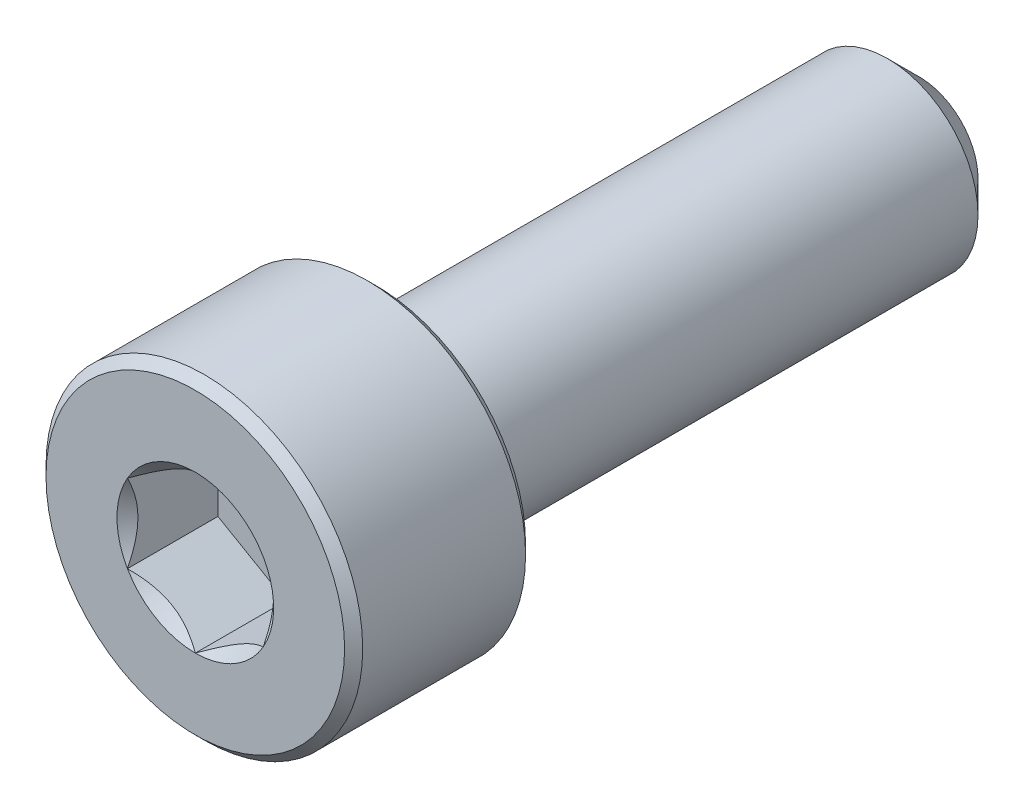
ISO-10303-21;
HEADER;
FILE_DESCRIPTION(('STEP AP214'),'2;1');
FILE_NAME('part.step','',(''),(''),'','','');
FILE_SCHEMA(('AUTOMOTIVE_DESIGN { 1 0 10303 214 1 1 1 1 }'));
ENDSEC;
DATA;
#1=APPLICATION_CONTEXT('core data for automotive mechanical design processes');
#2=APPLICATION_PROTOCOL_DEFINITION('international standard','automotive_design',2000,#1);
#3=PRODUCT_CONTEXT('',#1,'mechanical');
#4=PRODUCT('Part','Part','',(#3));
#5=PRODUCT_RELATED_PRODUCT_CATEGORY('part','',(#4));
#6=PRODUCT_DEFINITION_FORMATION('','',#4);
#7=PRODUCT_DEFINITION_CONTEXT('part definition',#1,'design');
#8=PRODUCT_DEFINITION('design','',#6,#7);
#9=PRODUCT_DEFINITION_SHAPE('','',#8);
#10=(LENGTH_UNIT() NAMED_UNIT(*) SI_UNIT(.MILLI.,.METRE.));
#11=(NAMED_UNIT(*) PLANE_ANGLE_UNIT() SI_UNIT($,.RADIAN.));
#12=(NAMED_UNIT(*) SI_UNIT($,.STERADIAN.) SOLID_ANGLE_UNIT());
#13=UNCERTAINTY_MEASURE_WITH_UNIT(LENGTH_MEASURE(1.E-05),#10,'distance_accuracy_value','');
#14=(GEOMETRIC_REPRESENTATION_CONTEXT(3) GLOBAL_UNCERTAINTY_ASSIGNED_CONTEXT((#13)) GLOBAL_UNIT_ASSIGNED_CONTEXT((#10,
#11,#12)) REPRESENTATION_CONTEXT('',''));
#15=CARTESIAN_POINT('',(0.,0.,0.));
#16=DIRECTION('',(0.,0.,1.));
#17=DIRECTION('',(1.,0.,0.));
#18=AXIS2_PLACEMENT_3D('',#15,#16,#17);
#19=CARTESIAN_POINT('',(0.,3.3,8.));
#20=DIRECTION('',(0.,0.,1.));
#21=DIRECTION('',(1.,0.,0.));
#22=AXIS2_PLACEMENT_3D('',#19,#20,#21);
#23=PLANE('',#22);
#24=CARTESIAN_POINT('',(0.,0.,8.));
#25=DIRECTION('',(0.,0.,1.));
#26=DIRECTION('',(1.,0.,0.));
#27=AXIS2_PLACEMENT_3D('',#24,#25,#26);
#28=CIRCLE('',#27,1.73205080756888);
#29=CARTESIAN_POINT('',(1.5,0.86602540378444,8.));
#30=VERTEX_POINT('',#29);
#31=CARTESIAN_POINT('',(0.,1.73205080756888,8.));
#32=VERTEX_POINT('',#31);
#33=EDGE_CURVE('E97',#30,#32,#28,.T.);
#34=ORIENTED_EDGE('',*,*,#33,.F.);
#35=CARTESIAN_POINT('',(1.5,-0.86602540378444,8.));
#36=VERTEX_POINT('',#35);
#37=EDGE_CURVE('E57',#36,#30,#28,.T.);
#38=ORIENTED_EDGE('',*,*,#37,.F.);
#39=CARTESIAN_POINT('',(0.,-1.73205080756888,8.));
#40=VERTEX_POINT('',#39);
#41=EDGE_CURVE('E283',#40,#36,#28,.T.);
#42=ORIENTED_EDGE('',*,*,#41,.F.);
#43=CARTESIAN_POINT('',(-1.5,-0.866025403784437,8.));
#44=VERTEX_POINT('',#43);
#45=EDGE_CURVE('E64',#44,#40,#28,.T.);
#46=ORIENTED_EDGE('',*,*,#45,.F.);
#47=CARTESIAN_POINT('',(-1.5,0.86602540378444,8.));
#48=VERTEX_POINT('',#47);
#49=EDGE_CURVE('E133',#48,#44,#28,.T.);
#50=ORIENTED_EDGE('',*,*,#49,.F.);
#51=EDGE_CURVE('E106',#32,#48,#28,.T.);
#52=ORIENTED_EDGE('',*,*,#51,.F.);
#53=EDGE_LOOP('',(#34,#38,#42,#46,#50,#52));
#54=FACE_BOUND('',#53,.T.);
#55=CARTESIAN_POINT('',(0.,0.,8.));
#56=DIRECTION('',(0.,0.,-1.));
#57=DIRECTION('',(-1.,0.,0.));
#58=AXIS2_PLACEMENT_3D('',#55,#56,#57);
#59=CIRCLE('',#58,3.3);
#60=CARTESIAN_POINT('',(-3.3,0.,8.));
#61=VERTEX_POINT('',#60);
#62=EDGE_CURVE('E51',#61,#61,#59,.T.);
#63=ORIENTED_EDGE('',*,*,#62,.F.);
#64=EDGE_LOOP('',(#63));
#65=FACE_BOUND('',#64,.T.);
#66=ADVANCED_FACE('F38',(#54,#65),#23,.T.);
#67=CARTESIAN_POINT('',(0.,0.,7.8));
#68=DIRECTION('',(0.,0.,-1.));
#69=DIRECTION('',(-1.,0.,0.));
#70=AXIS2_PLACEMENT_3D('',#67,#68,#69);
#71=CONICAL_SURFACE('',#70,3.5,0.785398163397449);
#72=ORIENTED_EDGE('',*,*,#62,.T.);
#73=EDGE_LOOP('',(#72));
#74=FACE_BOUND('',#73,.T.);
#75=CARTESIAN_POINT('',(0.,0.,7.8));
#76=DIRECTION('',(0.,0.,-1.));
#77=DIRECTION('',(-1.,0.,0.));
#78=AXIS2_PLACEMENT_3D('',#75,#76,#77);
#79=CIRCLE('',#78,3.5);
#80=CARTESIAN_POINT('',(-3.5,0.,7.8));
#81=VERTEX_POINT('',#80);
#82=EDGE_CURVE('E217',#81,#81,#79,.T.);
#83=ORIENTED_EDGE('',*,*,#82,.F.);
#84=EDGE_LOOP('',(#83));
#85=FACE_BOUND('',#84,.T.);
#86=ADVANCED_FACE('F222',(#74,#85),#71,.T.);
#87=CARTESIAN_POINT('',(0.,0.,-8.));
#88=DIRECTION('',(0.,0.,-1.));
#89=DIRECTION('',(-1.,0.,0.));
#90=AXIS2_PLACEMENT_3D('',#87,#88,#89);
#91=CYLINDRICAL_SURFACE('',#90,3.5);
#92=ORIENTED_EDGE('',*,*,#82,.T.);
#93=EDGE_LOOP('',(#92));
#94=FACE_BOUND('',#93,.T.);
#95=CARTESIAN_POINT('',(0.,0.,4.2));
#96=DIRECTION('',(0.,0.,-1.));
#97=DIRECTION('',(-1.,0.,0.));
#98=AXIS2_PLACEMENT_3D('',#95,#96,#97);
#99=CIRCLE('',#98,3.5);
#100=CARTESIAN_POINT('',(-3.5,0.,4.2));
#101=VERTEX_POINT('',#100);
#102=EDGE_CURVE('E214',#101,#101,#99,.T.);
#103=ORIENTED_EDGE('',*,*,#102,.F.);
#104=EDGE_LOOP('',(#103));
#105=FACE_BOUND('',#104,.T.);
#106=ADVANCED_FACE('F228',(#94,#105),#91,.T.);
#107=CARTESIAN_POINT('',(0.,0.,4.));
#108=DIRECTION('',(0.,0.,1.));
#109=DIRECTION('',(1.,0.,0.));
#110=AXIS2_PLACEMENT_3D('',#107,#108,#109);
#111=CONICAL_SURFACE('',#110,3.3,0.78539816339745);
#112=ORIENTED_EDGE('',*,*,#102,.T.);
#113=EDGE_LOOP('',(#112));
#114=FACE_BOUND('',#113,.T.);
#115=CARTESIAN_POINT('',(0.,0.,4.));
#116=DIRECTION('',(0.,0.,-1.));
#117=DIRECTION('',(-1.,0.,0.));
#118=AXIS2_PLACEMENT_3D('',#115,#116,#117);
#119=CIRCLE('',#118,3.3);
#120=CARTESIAN_POINT('',(-3.3,0.,4.));
#121=VERTEX_POINT('',#120);
#122=EDGE_CURVE('E211',#121,#121,#119,.T.);
#123=ORIENTED_EDGE('',*,*,#122,.F.);
#124=EDGE_LOOP('',(#123));
#125=FACE_BOUND('',#124,.T.);
#126=ADVANCED_FACE('F232',(#114,#125),#111,.T.);
#127=CARTESIAN_POINT('',(0.,3.3,4.));
#128=DIRECTION('',(0.,0.,-1.));
#129=DIRECTION('',(-1.,0.,0.));
#130=AXIS2_PLACEMENT_3D('',#127,#128,#129);
#131=PLANE('',#130);
#132=ORIENTED_EDGE('',*,*,#122,.T.);
#133=EDGE_LOOP('',(#132));
#134=FACE_BOUND('',#133,.T.);
#135=CARTESIAN_POINT('',(0.,0.,4.));
#136=DIRECTION('',(0.,0.,-1.));
#137=DIRECTION('',(-1.,0.,0.));
#138=AXIS2_PLACEMENT_3D('',#135,#136,#137);
#139=CIRCLE('',#138,2.);
#140=CARTESIAN_POINT('',(-2.,0.,4.));
#141=VERTEX_POINT('',#140);
#142=EDGE_CURVE('E208',#141,#141,#139,.T.);
#143=ORIENTED_EDGE('',*,*,#142,.F.);
#144=EDGE_LOOP('',(#143));
#145=FACE_BOUND('',#144,.T.);
#146=ADVANCED_FACE('F238',(#134,#145),#131,.T.);
#147=CARTESIAN_POINT('',(0.,0.,-8.));
#148=DIRECTION('',(0.,0.,-1.));
#149=DIRECTION('',(-1.,0.,0.));
#150=AXIS2_PLACEMENT_3D('',#147,#148,#149);
#151=CYLINDRICAL_SURFACE('',#150,2.);
#152=ORIENTED_EDGE('',*,*,#142,.T.);
#153=EDGE_LOOP('',(#152));
#154=FACE_BOUND('',#153,.T.);
#155=CARTESIAN_POINT('',(0.,0.,-7.29999999999999));
#156=DIRECTION('',(0.,0.,-1.));
#157=DIRECTION('',(-1.,0.,0.));
#158=AXIS2_PLACEMENT_3D('',#155,#156,#157);
#159=CIRCLE('',#158,2.);
#160=CARTESIAN_POINT('',(-2.,0.,-7.29999999999999));
#161=VERTEX_POINT('',#160);
#162=EDGE_CURVE('E205',#161,#161,#159,.T.);
#163=ORIENTED_EDGE('',*,*,#162,.F.);
#164=EDGE_LOOP('',(#163));
#165=FACE_BOUND('',#164,.T.);
#166=ADVANCED_FACE('F242',(#154,#165),#151,.T.);
#167=CARTESIAN_POINT('',(0.,0.,-8.));
#168=DIRECTION('',(0.,0.,1.));
#169=DIRECTION('',(1.,0.,0.));
#170=AXIS2_PLACEMENT_3D('',#167,#168,#169);
#171=CONICAL_SURFACE('',#170,1.3,0.785398163397442);
#172=ORIENTED_EDGE('',*,*,#162,.T.);
#173=EDGE_LOOP('',(#172));
#174=FACE_BOUND('',#173,.T.);
#175=CARTESIAN_POINT('',(0.,0.,-8.));
#176=DIRECTION('',(0.,0.,-1.));
#177=DIRECTION('',(-1.,0.,0.));
#178=AXIS2_PLACEMENT_3D('',#175,#176,#177);
#179=CIRCLE('',#178,1.3);
#180=CARTESIAN_POINT('',(-1.3,0.,-8.));
#181=VERTEX_POINT('',#180);
#182=EDGE_CURVE('E193',#181,#181,#179,.T.);
#183=ORIENTED_EDGE('',*,*,#182,.F.);
#184=EDGE_LOOP('',(#183));
#185=FACE_BOUND('',#184,.T.);
#186=ADVANCED_FACE('F245',(#174,#185),#171,.T.);
#187=CARTESIAN_POINT('',(0.,1.3,-8.));
#188=DIRECTION('',(0.,0.,-1.));
#189=DIRECTION('',(-1.,0.,0.));
#190=AXIS2_PLACEMENT_3D('',#187,#188,#189);
#191=PLANE('',#190);
#192=ORIENTED_EDGE('',*,*,#182,.T.);
#193=EDGE_LOOP('',(#192));
#194=FACE_BOUND('',#193,.T.);
#195=ADVANCED_FACE('F166',(#194),#191,.T.);
#196=CARTESIAN_POINT('',(0.,0.,8.));
#197=DIRECTION('',(0.,0.,1.));
#198=DIRECTION('',(1.,0.,0.));
#199=AXIS2_PLACEMENT_3D('',#196,#197,#198);
#200=CONICAL_SURFACE('',#199,1.73205080756888,0.78539816339745);
#201=ORIENTED_EDGE('',*,*,#51,.T.);
#202=CARTESIAN_POINT('',(0.000200000000000415,1.73216627762272,8.00011548160007));
#203=CARTESIAN_POINT('',(-0.051367790737075,1.70239359975915,7.97036547606733));
#204=CARTESIAN_POINT('',(-0.1037979176652,1.67212305186355,7.94236248391031));
#205=CARTESIAN_POINT('',(-0.210709034055596,1.61039789003619,7.89108923044015));
#206=CARTESIAN_POINT('',(-0.265200195814661,1.57893740312614,7.86784750504438));
#207=CARTESIAN_POINT('',(-0.375079081357249,1.51549879897987,7.82803372899222));
#208=CARTESIAN_POINT('',(-0.4304388090952,1.4835368452681,7.8113615856709));
#209=CARTESIAN_POINT('',(-0.54237725747715,1.41890915196211,7.7856744568181));
#210=CARTESIAN_POINT('',(-0.598952556553009,1.38624538781118,7.77664029047887));
#211=CARTESIAN_POINT('',(-0.696455389516441,1.32995210095299,7.76848908122685));
#212=CARTESIAN_POINT('',(-0.737256908280467,1.30639533311124,7.76728225298922));
#213=CARTESIAN_POINT('',(-0.818787969615859,1.25932335290193,7.76931405716227));
#214=CARTESIAN_POINT('',(-0.85951749431463,1.23580815085313,7.77255367074831));
#215=CARTESIAN_POINT('',(-0.940584402163417,1.18900414978427,7.78329198598196));
#216=CARTESIAN_POINT('',(-0.980921384598289,1.1657155821172,7.79079465301873));
#217=CARTESIAN_POINT('',(-1.06091833691403,1.11952932016335,7.80965161192829));
#218=CARTESIAN_POINT('',(-1.10057800851621,1.09663179808786,7.82100755701859));
#219=CARTESIAN_POINT('',(-1.20216313477449,1.03798159809698,7.85472164759267));
#220=CARTESIAN_POINT('',(-1.26345855370969,1.00259267147465,7.87962184909337));
#221=CARTESIAN_POINT('',(-1.35358562846331,0.950557780604375,7.92165665327158));
#222=CARTESIAN_POINT('',(-1.38328513990772,0.933410759677148,7.9364251535591));
#223=CARTESIAN_POINT('',(-1.44213790138375,0.899432101996407,7.96731056594017));
#224=CARTESIAN_POINT('',(-1.47129140422064,0.88260031928571,7.98342683412171));
#225=CARTESIAN_POINT('',(-1.5002,0.865909933730601,8.00011548160007));
#226=B_SPLINE_CURVE_WITH_KNOTS('',3,(#202,#203,#204,#205,#206,#207,#208,#209,#210,#211,#212,
#213,#214,#215,#216,#217,#218,#219,#220,#221,#222,#223,#224,#225),.UNSPECIFIED.,.F.,.F.,(4,2,2,
2,2,2,2,2,2,2,2,4),(0.,0.199829143693304,0.400822987382389,0.598623720538181,0.79592624018889,
0.937113067959882,1.07833105577193,1.21968061668222,1.36109089931055,1.58570969637566,
1.69770705470964,1.80965120737194),.UNSPECIFIED.);
#227=EDGE_CURVE('E11',#32,#48,#226,.T.);
#228=ORIENTED_EDGE('',*,*,#227,.F.);
#229=EDGE_LOOP('',(#201,#228));
#230=FACE_BOUND('',#229,.T.);
#231=ADVANCED_FACE('F110',(#230),#200,.F.);
#232=ORIENTED_EDGE('',*,*,#49,.T.);
#233=CARTESIAN_POINT('',(-1.5,-1.70094076570699,8.53581150933748));
#234=CARTESIAN_POINT('',(-1.5,-1.65940339844307,8.50466245356307));
#235=CARTESIAN_POINT('',(-1.5,-1.61763176138548,8.47382664603814));
#236=CARTESIAN_POINT('',(-1.5,-1.53352581710889,8.41291005817041));
#237=CARTESIAN_POINT('',(-1.5,-1.49119136858461,8.38282947313436));
#238=CARTESIAN_POINT('',(-1.5,-1.36258344501966,8.29348482963312));
#239=CARTESIAN_POINT('',(-1.5,-1.27533705988673,8.23559781348778));
#240=CARTESIAN_POINT('',(-1.5,-1.09255216894207,8.12219567429685));
#241=CARTESIAN_POINT('',(-1.5,-0.996821581803493,8.06698654757307));
#242=CARTESIAN_POINT('',(-1.5,-0.800613082291591,7.9661637894456));
#243=CARTESIAN_POINT('',(-1.5,-0.700152604862087,7.92051785177961));
#244=CARTESIAN_POINT('',(-1.5,-0.549105960820993,7.86468252969872));
#245=CARTESIAN_POINT('',(-1.5,-0.500700743628039,7.84861439232622));
#246=CARTESIAN_POINT('',(-1.5,-0.40274469507941,7.82036772251469));
#247=CARTESIAN_POINT('',(-1.5,-0.353193782853662,7.80818946555124));
#248=CARTESIAN_POINT('',(-1.5,-0.254057869430009,7.78855091399036));
#249=CARTESIAN_POINT('',(-1.5,-0.204488814603775,7.78101136158588));
#250=CARTESIAN_POINT('',(-1.5,-0.104849462627796,7.77079321692886));
#251=CARTESIAN_POINT('',(-1.5,-0.054779247575758,7.76811384119743));
#252=CARTESIAN_POINT('',(-1.5,0.0436737229088438,7.76780462686181));
#253=CARTESIAN_POINT('',(-1.5,0.0920560164094801,7.77000633072589));
#254=CARTESIAN_POINT('',(-1.5,0.188397733218518,7.77897258823616));
#255=CARTESIAN_POINT('',(-1.5,0.236357072029981,7.78573803359405));
#256=CARTESIAN_POINT('',(-1.5,0.332310053939587,7.80358163901288));
#257=CARTESIAN_POINT('',(-1.5,0.380290051019947,7.81473209678684));
#258=CARTESIAN_POINT('',(-1.5,0.475204866701384,7.84076106187732));
#259=CARTESIAN_POINT('',(-1.5,0.522139781196709,7.85563922560085));
#260=CARTESIAN_POINT('',(-1.5,0.67113584923772,7.90843439268167));
#261=CARTESIAN_POINT('',(-1.5,0.771043708402958,7.95241449643641));
#262=CARTESIAN_POINT('',(-1.5,0.966154320771711,8.05016194816059));
#263=CARTESIAN_POINT('',(-1.5,1.06133841027248,8.10396471049644));
#264=CARTESIAN_POINT('',(-1.5,1.24322962123133,8.21492426634355));
#265=CARTESIAN_POINT('',(-1.5,1.33012275327054,8.27177988846287));
#266=CARTESIAN_POINT('',(-1.5,1.45814294533514,8.35965573982338));
#267=CARTESIAN_POINT('',(-1.5,1.50026316125082,8.38925424362582));
#268=CARTESIAN_POINT('',(-1.5,1.58392901779071,8.44922957252824));
#269=CARTESIAN_POINT('',(-1.5,1.62547481197907,8.47960618316485));
#270=CARTESIAN_POINT('',(-1.5,1.66678158585385,8.51030528702036));
#271=B_SPLINE_CURVE_WITH_KNOTS('',3,(#233,#234,#235,#236,#237,#238,#239,#240,#241,#242,#243,
#244,#245,#246,#247,#248,#249,#250,#251,#252,#253,#254,#255,#256,#257,#258,#259,#260,#261,#262,
#263,#264,#265,#266,#267,#268,#269,#270),.UNSPECIFIED.,.F.,.F.,(4,2,2,2,2,2,2,2,2,2,2,2,2,2,2,2,
2,2,4),(0.,0.155753948201003,0.311547769199354,0.625513832410581,0.956763614654479,
1.28687565594417,1.43975300144579,1.59264117109685,1.74283872260253,1.89301205954152,
2.03808349452257,2.1831832832956,2.33078307442231,2.47836926586908,2.80488410158813,
3.13260026706957,3.44396956433299,3.59840353500356,3.75279538879849),.UNSPECIFIED.);
#272=EDGE_CURVE('E105',#48,#44,#271,.F.);
#273=ORIENTED_EDGE('',*,*,#272,.F.);
#274=EDGE_LOOP('',(#232,#273));
#275=FACE_BOUND('',#274,.T.);
#276=ADVANCED_FACE('F260',(#275),#200,.F.);
#277=ORIENTED_EDGE('',*,*,#45,.T.);
#278=CARTESIAN_POINT('',(-1.5002,-0.865909933730601,8.00011548160007));
#279=CARTESIAN_POINT('',(-1.44863220926292,-0.895682611594166,7.97036547606733));
#280=CARTESIAN_POINT('',(-1.3962020823348,-0.925953159489765,7.94236248391031));
#281=CARTESIAN_POINT('',(-1.2892909659444,-0.987678321317123,7.89108923044014));
#282=CARTESIAN_POINT('',(-1.23479980418534,-1.01913880822717,7.86784750504437));
#283=CARTESIAN_POINT('',(-1.12492091864275,-1.08257741237344,7.82803372899222));
#284=CARTESIAN_POINT('',(-1.0695611909048,-1.11453936608521,7.8113615856709));
#285=CARTESIAN_POINT('',(-0.957622742522849,-1.1791670593912,7.7856744568181));
#286=CARTESIAN_POINT('',(-0.901047443446992,-1.21183082354213,7.77664029047887));
#287=CARTESIAN_POINT('',(-0.803544610483559,-1.26812411040032,7.76848908122685));
#288=CARTESIAN_POINT('',(-0.762743091719534,-1.29168087824208,7.76728225298922));
#289=CARTESIAN_POINT('',(-0.681212030384142,-1.33875285845138,7.76931405716227));
#290=CARTESIAN_POINT('',(-0.64048250568537,-1.36226806050018,7.77255367074831));
#291=CARTESIAN_POINT('',(-0.559415597836584,-1.40907206156905,7.78329198598196));
#292=CARTESIAN_POINT('',(-0.519078615401712,-1.43236062923612,7.79079465301874));
#293=CARTESIAN_POINT('',(-0.439081663085969,-1.47854689118996,7.80965161192829));
#294=CARTESIAN_POINT('',(-0.399421991483792,-1.50144441326545,7.82100755701859));
#295=CARTESIAN_POINT('',(-0.297836865225515,-1.56009461325633,7.85472164759267));
#296=CARTESIAN_POINT('',(-0.236541446290311,-1.59548353987866,7.87962184909337));
#297=CARTESIAN_POINT('',(-0.146414371536687,-1.64751843074894,7.92165665327158));
#298=CARTESIAN_POINT('',(-0.116714860092283,-1.66466545167617,7.9364251535591));
#299=CARTESIAN_POINT('',(-0.0578620986162494,-1.69864410935691,7.96731056594017));
#300=CARTESIAN_POINT('',(-0.0287085957793631,-1.71547589206761,7.98342683412171));
#301=CARTESIAN_POINT('',(0.000199999999999556,-1.73216627762272,8.00011548160007));
#302=B_SPLINE_CURVE_WITH_KNOTS('',3,(#278,#279,#280,#281,#282,#283,#284,#285,#286,#287,#288,
#289,#290,#291,#292,#293,#294,#295,#296,#297,#298,#299,#300,#301),.UNSPECIFIED.,.F.,.F.,(4,2,2,
2,2,2,2,2,2,2,2,4),(0.,0.199829143693305,0.400822987382389,0.598623720538182,0.79592624018889,
0.937113067959882,1.07833105577193,1.21968061668222,1.36109089931054,1.58570969637565,
1.69770705470964,1.80965120737194),.UNSPECIFIED.);
#303=EDGE_CURVE('E142',#44,#40,#302,.T.);
#304=ORIENTED_EDGE('',*,*,#303,.F.);
#305=EDGE_LOOP('',(#277,#304));
#306=FACE_BOUND('',#305,.T.);
#307=ADVANCED_FACE('F264',(#306),#200,.F.);
#308=ORIENTED_EDGE('',*,*,#41,.T.);
#309=CARTESIAN_POINT('',(-0.000200000000000533,-1.73216627762272,8.00011548160007));
#310=CARTESIAN_POINT('',(0.0513677907370753,-1.70239359975915,7.97036547606733));
#311=CARTESIAN_POINT('',(0.1037979176652,-1.67212305186355,7.94236248391031));
#312=CARTESIAN_POINT('',(0.210709034055596,-1.61039789003619,7.89108923044014));
#313=CARTESIAN_POINT('',(0.26520019581466,-1.57893740312614,7.86784750504437));
#314=CARTESIAN_POINT('',(0.375079081357248,-1.51549879897987,7.82803372899222));
#315=CARTESIAN_POINT('',(0.4304388090952,-1.4835368452681,7.8113615856709));
#316=CARTESIAN_POINT('',(0.542377257477151,-1.41890915196211,7.7856744568181));
#317=CARTESIAN_POINT('',(0.598952556553009,-1.38624538781118,7.77664029047887));
#318=CARTESIAN_POINT('',(0.696455389516441,-1.32995210095299,7.76848908122685));
#319=CARTESIAN_POINT('',(0.737256908280467,-1.30639533311124,7.76728225298922));
#320=CARTESIAN_POINT('',(0.818787969615859,-1.25932335290193,7.76931405716227));
#321=CARTESIAN_POINT('',(0.85951749431463,-1.23580815085313,7.77255367074831));
#322=CARTESIAN_POINT('',(0.940584402163416,-1.18900414978427,7.78329198598196));
#323=CARTESIAN_POINT('',(0.980921384598288,-1.1657155821172,7.79079465301873));
#324=CARTESIAN_POINT('',(1.06091833691403,-1.11952932016335,7.80965161192829));
#325=CARTESIAN_POINT('',(1.10057800851621,-1.09663179808786,7.82100755701859));
#326=CARTESIAN_POINT('',(1.20216313477449,-1.03798159809698,7.85472164759267));
#327=CARTESIAN_POINT('',(1.26345855370969,-1.00259267147465,7.87962184909337));
#328=CARTESIAN_POINT('',(1.35358562846331,-0.950557780604375,7.92165665327158));
#329=CARTESIAN_POINT('',(1.38328513990772,-0.933410759677148,7.9364251535591));
#330=CARTESIAN_POINT('',(1.44213790138375,-0.899432101996408,7.96731056594017));
#331=CARTESIAN_POINT('',(1.47129140422064,-0.882600319285711,7.98342683412171));
#332=CARTESIAN_POINT('',(1.5002,-0.865909933730602,8.00011548160007));
#333=B_SPLINE_CURVE_WITH_KNOTS('',3,(#309,#310,#311,#312,#313,#314,#315,#316,#317,#318,#319,
#320,#321,#322,#323,#324,#325,#326,#327,#328,#329,#330,#331,#332),.UNSPECIFIED.,.F.,.F.,(4,2,2,
2,2,2,2,2,2,2,2,4),(0.,0.199829143693305,0.400822987382389,0.598623720538182,0.79592624018889,
0.937113067959882,1.07833105577193,1.21968061668222,1.36109089931055,1.58570969637565,
1.69770705470964,1.80965120737194),.UNSPECIFIED.);
#334=EDGE_CURVE('E285',#40,#36,#333,.T.);
#335=ORIENTED_EDGE('',*,*,#334,.F.);
#336=EDGE_LOOP('',(#308,#335));
#337=FACE_BOUND('',#336,.T.);
#338=ADVANCED_FACE('F273',(#337),#200,.F.);
#339=ORIENTED_EDGE('',*,*,#37,.T.);
#340=CARTESIAN_POINT('',(1.5,-1.70094076506827,8.53581150885843));
#341=CARTESIAN_POINT('',(1.5,-1.65940339782208,8.50466245310243));
#342=CARTESIAN_POINT('',(1.5,-1.61763176078228,8.47382664559589));
#343=CARTESIAN_POINT('',(1.5,-1.53352581654145,8.41291005776482));
#344=CARTESIAN_POINT('',(1.5,-1.49119136803515,8.38282947274705));
#345=CARTESIAN_POINT('',(1.5,-1.36258344452521,8.29348482930099));
#346=CARTESIAN_POINT('',(1.5,-1.2753370594297,8.23559781319227));
#347=CARTESIAN_POINT('',(1.5,-1.09255216856664,8.1221956740766));
#348=CARTESIAN_POINT('',(1.5,-0.996821581472455,8.06698654739118));
#349=CARTESIAN_POINT('',(1.5,-0.800613082053126,7.96616378933478));
#350=CARTESIAN_POINT('',(1.5,-0.70015260467177,7.92051785170157));
#351=CARTESIAN_POINT('',(1.5,-0.549105960667007,7.86468252964533));
#352=CARTESIAN_POINT('',(1.5,-0.500700743459033,7.8486143922722));
#353=CARTESIAN_POINT('',(1.5,-0.402744694879906,7.82036772246244));
#354=CARTESIAN_POINT('',(1.5,-0.353193782638679,7.80818946550141));
#355=CARTESIAN_POINT('',(1.5,-0.254057869184595,7.78855091394885));
#356=CARTESIAN_POINT('',(1.5,-0.204488814343416,7.78101136155019));
#357=CARTESIAN_POINT('',(1.5,-0.104849462338083,7.77079321690814));
#358=CARTESIAN_POINT('',(1.5,-0.0547792472716359,7.76811384118586));
#359=CARTESIAN_POINT('',(1.5,0.0436737232403028,7.76780462687103));
#360=CARTESIAN_POINT('',(1.5,0.0920560167539031,7.77000633074664));
#361=CARTESIAN_POINT('',(1.5,0.188397733587633,7.77897258828183));
#362=CARTESIAN_POINT('',(1.5,0.236357072410824,7.78573803365309));
#363=CARTESIAN_POINT('',(1.5,0.332310054343574,7.80358163910001));
#364=CARTESIAN_POINT('',(1.5,0.380290051435317,7.81473209688875));
#365=CARTESIAN_POINT('',(1.5,0.475204867138458,7.84076106200917));
#366=CARTESIAN_POINT('',(1.5,0.522139781644104,7.85563922574786));
#367=CARTESIAN_POINT('',(1.5,0.671135849783408,7.90843439290061));
#368=CARTESIAN_POINT('',(1.5,0.771043709031689,7.9524144967216));
#369=CARTESIAN_POINT('',(1.5,0.96615432156016,8.05016194858556));
#370=CARTESIAN_POINT('',(1.5,1.06133841113756,8.103964710995));
#371=CARTESIAN_POINT('',(1.5,1.24322962223427,8.21492426698296));
#372=CARTESIAN_POINT('',(1.5,1.33012275433518,8.2717798891689));
#373=CARTESIAN_POINT('',(1.5,1.45814294649102,8.35965574062901));
#374=CARTESIAN_POINT('',(1.5,1.50026316243668,8.38925424446438));
#375=CARTESIAN_POINT('',(1.5,1.58392901903632,8.44922957343262));
#376=CARTESIAN_POINT('',(1.5,1.62547481325447,8.47960618410212));
#377=CARTESIAN_POINT('',(1.5,1.66678158715899,8.51030528799048));
#378=B_SPLINE_CURVE_WITH_KNOTS('',3,(#340,#341,#342,#343,#344,#345,#346,#347,#348,#349,#350,
#351,#352,#353,#354,#355,#356,#357,#358,#359,#360,#361,#362,#363,#364,#365,#366,#367,#368,#369,
#370,#371,#372,#373,#374,#375,#376,#377),.UNSPECIFIED.,.F.,.F.,(4,2,2,2,2,2,2,2,2,2,2,2,2,2,2,2,
2,2,4),(0.,0.155753948125309,0.311547769047943,0.625513832104914,0.95676361417602,
1.28687565529455,1.43975300083937,1.59264117053357,1.74283872208071,1.89301205906115,
2.03808349408246,2.18318328289585,2.33078307406584,2.47836926555587,2.80488410158167,
3.13260026737189,3.44396956489968,3.59840353570064,3.75279538962595),.UNSPECIFIED.);
#379=EDGE_CURVE('E122',#36,#30,#378,.T.);
#380=ORIENTED_EDGE('',*,*,#379,.F.);
#381=EDGE_LOOP('',(#339,#380));
#382=FACE_BOUND('',#381,.T.);
#383=ADVANCED_FACE('F267',(#382),#200,.F.);
#384=ORIENTED_EDGE('',*,*,#33,.T.);
#385=CARTESIAN_POINT('',(1.5002,0.865909933730602,8.00011548160007));
#386=CARTESIAN_POINT('',(1.44863220926292,0.895682611594167,7.97036547606733));
#387=CARTESIAN_POINT('',(1.3962020823348,0.925953159489766,7.94236248391031));
#388=CARTESIAN_POINT('',(1.2892909659444,0.987678321317125,7.89108923044014));
#389=CARTESIAN_POINT('',(1.23479980418534,1.01913880822718,7.86784750504437));
#390=CARTESIAN_POINT('',(1.12492091864275,1.08257741237344,7.82803372899222));
#391=CARTESIAN_POINT('',(1.0695611909048,1.11453936608522,7.8113615856709));
#392=CARTESIAN_POINT('',(0.957622742522848,1.1791670593912,7.7856744568181));
#393=CARTESIAN_POINT('',(0.90104744344699,1.21183082354213,7.77664029047887));
#394=CARTESIAN_POINT('',(0.803544610483558,1.26812411040032,7.76848908122685));
#395=CARTESIAN_POINT('',(0.762743091719533,1.29168087824208,7.76728225298922));
#396=CARTESIAN_POINT('',(0.681212030384141,1.33875285845138,7.76931405716227));
#397=CARTESIAN_POINT('',(0.640482505685369,1.36226806050018,7.77255367074831));
#398=CARTESIAN_POINT('',(0.559415597836583,1.40907206156905,7.78329198598196));
#399=CARTESIAN_POINT('',(0.51907861540171,1.43236062923612,7.79079465301873));
#400=CARTESIAN_POINT('',(0.439081663085968,1.47854689118997,7.80965161192829));
#401=CARTESIAN_POINT('',(0.399421991483791,1.50144441326545,7.82100755701859));
#402=CARTESIAN_POINT('',(0.297836865225514,1.56009461325633,7.85472164759267));
#403=CARTESIAN_POINT('',(0.23654144629031,1.59548353987866,7.87962184909337));
#404=CARTESIAN_POINT('',(0.146414371536686,1.64751843074894,7.92165665327158));
#405=CARTESIAN_POINT('',(0.116714860092282,1.66466545167617,7.9364251535591));
#406=CARTESIAN_POINT('',(0.057862098616249,1.69864410935691,7.96731056594017));
#407=CARTESIAN_POINT('',(0.0287085957793629,1.71547589206761,7.98342683412171));
#408=CARTESIAN_POINT('',(-0.000199999999999834,1.73216627762272,8.00011548160007));
#409=B_SPLINE_CURVE_WITH_KNOTS('',3,(#385,#386,#387,#388,#389,#390,#391,#392,#393,#394,#395,
#396,#397,#398,#399,#400,#401,#402,#403,#404,#405,#406,#407,#408),.UNSPECIFIED.,.F.,.F.,(4,2,2,
2,2,2,2,2,2,2,2,4),(0.,0.199829143693304,0.400822987382389,0.598623720538181,0.79592624018889,
0.937113067959882,1.07833105577193,1.21968061668222,1.36109089931054,1.58570969637565,
1.69770705470964,1.80965120737194),.UNSPECIFIED.);
#410=EDGE_CURVE('E101',#30,#32,#409,.T.);
#411=ORIENTED_EDGE('',*,*,#410,.F.);
#412=EDGE_LOOP('',(#384,#411));
#413=FACE_BOUND('',#412,.T.);
#414=ADVANCED_FACE('F99',(#413),#200,.F.);
#415=CARTESIAN_POINT('',(0.,0.,6.));
#416=DIRECTION('',(0.,0.,1.));
#417=DIRECTION('',(1.,0.,0.));
#418=AXIS2_PLACEMENT_3D('',#415,#416,#417);
#419=PLANE('',#418);
#420=DIRECTION('',(-0.866025403784439,0.5,0.));
#421=VECTOR('',#420,1.);
#422=CARTESIAN_POINT('',(1.5,0.86602540378444,6.));
#423=LINE('',#422,#421);
#424=CARTESIAN_POINT('',(1.5,0.86602540378444,6.));
#425=VERTEX_POINT('',#424);
#426=CARTESIAN_POINT('',(0.,1.73205080756888,6.));
#427=VERTEX_POINT('',#426);
#428=EDGE_CURVE('E121',#425,#427,#423,.T.);
#429=ORIENTED_EDGE('',*,*,#428,.T.);
#430=DIRECTION('',(-0.866025403784439,-0.5,0.));
#431=VECTOR('',#430,1.);
#432=CARTESIAN_POINT('',(0.,1.73205080756888,6.));
#433=LINE('',#432,#431);
#434=CARTESIAN_POINT('',(-1.5,0.866025403784439,6.));
#435=VERTEX_POINT('',#434);
#436=EDGE_CURVE('E126',#427,#435,#433,.T.);
#437=ORIENTED_EDGE('',*,*,#436,.T.);
#438=DIRECTION('',(0.,-1.,0.));
#439=VECTOR('',#438,1.);
#440=CARTESIAN_POINT('',(-1.5,0.866025403784439,6.));
#441=LINE('',#440,#439);
#442=CARTESIAN_POINT('',(-1.5,-0.866025403784439,6.));
#443=VERTEX_POINT('',#442);
#444=EDGE_CURVE('E181',#435,#443,#441,.T.);
#445=ORIENTED_EDGE('',*,*,#444,.T.);
#446=DIRECTION('',(0.866025403784439,-0.5,0.));
#447=VECTOR('',#446,1.);
#448=CARTESIAN_POINT('',(-1.5,-0.866025403784439,6.));
#449=LINE('',#448,#447);
#450=CARTESIAN_POINT('',(0.,-1.73205080756888,6.));
#451=VERTEX_POINT('',#450);
#452=EDGE_CURVE('E184',#443,#451,#449,.T.);
#453=ORIENTED_EDGE('',*,*,#452,.T.);
#454=DIRECTION('',(0.866025403784439,0.5,0.));
#455=VECTOR('',#454,1.);
#456=CARTESIAN_POINT('',(0.,-1.73205080756888,6.));
#457=LINE('',#456,#455);
#458=CARTESIAN_POINT('',(1.5,-0.86602540378444,6.));
#459=VERTEX_POINT('',#458);
#460=EDGE_CURVE('E187',#451,#459,#457,.T.);
#461=ORIENTED_EDGE('',*,*,#460,.T.);
#462=DIRECTION('',(0.,1.,0.));
#463=VECTOR('',#462,1.);
#464=CARTESIAN_POINT('',(1.5,-0.86602540378444,6.));
#465=LINE('',#464,#463);
#466=EDGE_CURVE('E129',#459,#425,#465,.T.);
#467=ORIENTED_EDGE('',*,*,#466,.T.);
#468=EDGE_LOOP('',(#429,#437,#445,#453,#461,#467));
#469=FACE_BOUND('',#468,.T.);
#470=ADVANCED_FACE('F161',(#469),#419,.T.);
#471=CARTESIAN_POINT('',(0.,1.73205080756888,6.));
#472=DIRECTION('',(-0.5,0.866025403784439,0.));
#473=DIRECTION('',(-0.866025403784439,-0.5,0.));
#474=AXIS2_PLACEMENT_3D('',#471,#472,#473);
#475=PLANE('',#474);
#476=DIRECTION('',(0.,0.,1.));
#477=VECTOR('',#476,1.);
#478=CARTESIAN_POINT('',(0.,1.73205080756888,6.));
#479=LINE('',#478,#477);
#480=EDGE_CURVE('E118',#427,#32,#479,.T.);
#481=ORIENTED_EDGE('',*,*,#480,.T.);
#482=ORIENTED_EDGE('',*,*,#227,.T.);
#483=DIRECTION('',(0.,0.,1.));
#484=VECTOR('',#483,1.);
#485=CARTESIAN_POINT('',(-1.5,0.866025403784439,6.));
#486=LINE('',#485,#484);
#487=EDGE_CURVE('E128',#435,#48,#486,.T.);
#488=ORIENTED_EDGE('',*,*,#487,.F.);
#489=ORIENTED_EDGE('',*,*,#436,.F.);
#490=EDGE_LOOP('',(#481,#482,#488,#489));
#491=FACE_BOUND('',#490,.T.);
#492=ADVANCED_FACE('F124',(#491),#475,.F.);
#493=CARTESIAN_POINT('',(-1.5,0.866025403784439,6.));
#494=DIRECTION('',(-1.,0.,0.));
#495=DIRECTION('',(0.,-1.,0.));
#496=AXIS2_PLACEMENT_3D('',#493,#494,#495);
#497=PLANE('',#496);
#498=ORIENTED_EDGE('',*,*,#487,.T.);
#499=ORIENTED_EDGE('',*,*,#272,.T.);
#500=DIRECTION('',(0.,0.,1.));
#501=VECTOR('',#500,1.);
#502=CARTESIAN_POINT('',(-1.5,-0.866025403784439,6.));
#503=LINE('',#502,#501);
#504=EDGE_CURVE('E199',#443,#44,#503,.T.);
#505=ORIENTED_EDGE('',*,*,#504,.F.);
#506=ORIENTED_EDGE('',*,*,#444,.F.);
#507=EDGE_LOOP('',(#498,#499,#505,#506));
#508=FACE_BOUND('',#507,.T.);
#509=ADVANCED_FACE('F151',(#508),#497,.F.);
#510=CARTESIAN_POINT('',(-1.5,-0.866025403784439,6.));
#511=DIRECTION('',(-0.5,-0.866025403784439,0.));
#512=DIRECTION('',(0.866025403784439,-0.5,0.));
#513=AXIS2_PLACEMENT_3D('',#510,#511,#512);
#514=PLANE('',#513);
#515=ORIENTED_EDGE('',*,*,#504,.T.);
#516=ORIENTED_EDGE('',*,*,#303,.T.);
#517=DIRECTION('',(0.,0.,1.));
#518=VECTOR('',#517,1.);
#519=CARTESIAN_POINT('',(0.,-1.73205080756888,6.));
#520=LINE('',#519,#518);
#521=EDGE_CURVE('E196',#451,#40,#520,.T.);
#522=ORIENTED_EDGE('',*,*,#521,.F.);
#523=ORIENTED_EDGE('',*,*,#452,.F.);
#524=EDGE_LOOP('',(#515,#516,#522,#523));
#525=FACE_BOUND('',#524,.T.);
#526=ADVANCED_FACE('F154',(#525),#514,.F.);
#527=CARTESIAN_POINT('',(0.,-1.73205080756888,6.));
#528=DIRECTION('',(0.5,-0.866025403784439,0.));
#529=DIRECTION('',(0.866025403784439,0.5,0.));
#530=AXIS2_PLACEMENT_3D('',#527,#528,#529);
#531=PLANE('',#530);
#532=ORIENTED_EDGE('',*,*,#521,.T.);
#533=ORIENTED_EDGE('',*,*,#334,.T.);
#534=DIRECTION('',(0.,0.,1.));
#535=VECTOR('',#534,1.);
#536=CARTESIAN_POINT('',(1.5,-0.86602540378444,6.));
#537=LINE('',#536,#535);
#538=EDGE_CURVE('E194',#459,#36,#537,.T.);
#539=ORIENTED_EDGE('',*,*,#538,.F.);
#540=ORIENTED_EDGE('',*,*,#460,.F.);
#541=EDGE_LOOP('',(#532,#533,#539,#540));
#542=FACE_BOUND('',#541,.T.);
#543=ADVANCED_FACE('F291',(#542),#531,.F.);
#544=CARTESIAN_POINT('',(1.5,-0.86602540378444,6.));
#545=DIRECTION('',(1.,0.,0.));
#546=DIRECTION('',(0.,0.,-1.));
#547=AXIS2_PLACEMENT_3D('',#544,#545,#546);
#548=PLANE('',#547);
#549=ORIENTED_EDGE('',*,*,#538,.T.);
#550=ORIENTED_EDGE('',*,*,#379,.T.);
#551=DIRECTION('',(0.,0.,1.));
#552=VECTOR('',#551,1.);
#553=CARTESIAN_POINT('',(1.5,0.86602540378444,6.));
#554=LINE('',#553,#552);
#555=EDGE_CURVE('E120',#425,#30,#554,.T.);
#556=ORIENTED_EDGE('',*,*,#555,.F.);
#557=ORIENTED_EDGE('',*,*,#466,.F.);
#558=EDGE_LOOP('',(#549,#550,#556,#557));
#559=FACE_BOUND('',#558,.T.);
#560=ADVANCED_FACE('F165',(#559),#548,.F.);
#561=CARTESIAN_POINT('',(1.5,0.86602540378444,6.));
#562=DIRECTION('',(0.5,0.866025403784439,0.));
#563=DIRECTION('',(-0.866025403784439,0.5,0.));
#564=AXIS2_PLACEMENT_3D('',#561,#562,#563);
#565=PLANE('',#564);
#566=ORIENTED_EDGE('',*,*,#555,.T.);
#567=ORIENTED_EDGE('',*,*,#410,.T.);
#568=ORIENTED_EDGE('',*,*,#480,.F.);
#569=ORIENTED_EDGE('',*,*,#428,.F.);
#570=EDGE_LOOP('',(#566,#567,#568,#569));
#571=FACE_BOUND('',#570,.T.);
#572=ADVANCED_FACE('F116',(#571),#565,.F.);
#573=CLOSED_SHELL('',(#66,#86,#106,#126,#146,#166,#186,#195,#231,#276,#307,#338,#383,#414,#470,
#492,#509,#526,#543,#560,#572));
#574=MANIFOLD_SOLID_BREP('B2',#573);
#575=ADVANCED_BREP_SHAPE_REPRESENTATION('',(#18,#574),#14);
#576=SHAPE_DEFINITION_REPRESENTATION(#9,#575);
ENDSEC;
END-ISO-10303-21;
